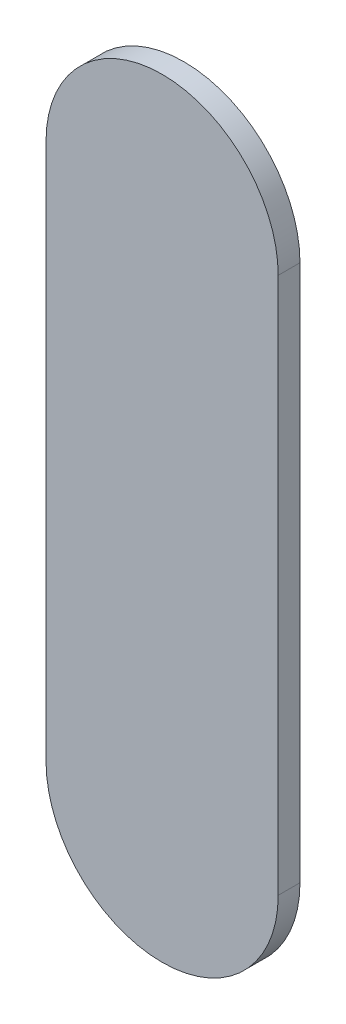
ISO-10303-21;
HEADER;
FILE_DESCRIPTION(('STEP AP214'),'2;1');
FILE_NAME('part.step','',(''),(''),'','','');
FILE_SCHEMA(('AUTOMOTIVE_DESIGN { 1 0 10303 214 1 1 1 1 }'));
ENDSEC;
DATA;
#1=APPLICATION_CONTEXT('core data for automotive mechanical design processes');
#2=APPLICATION_PROTOCOL_DEFINITION('international standard','automotive_design',2000,#1);
#3=PRODUCT_CONTEXT('',#1,'mechanical');
#4=PRODUCT('Part','Part','',(#3));
#5=PRODUCT_RELATED_PRODUCT_CATEGORY('part','',(#4));
#6=PRODUCT_DEFINITION_FORMATION('','',#4);
#7=PRODUCT_DEFINITION_CONTEXT('part definition',#1,'design');
#8=PRODUCT_DEFINITION('design','',#6,#7);
#9=PRODUCT_DEFINITION_SHAPE('','',#8);
#10=(LENGTH_UNIT() NAMED_UNIT(*) SI_UNIT(.MILLI.,.METRE.));
#11=(NAMED_UNIT(*) PLANE_ANGLE_UNIT() SI_UNIT($,.RADIAN.));
#12=(NAMED_UNIT(*) SI_UNIT($,.STERADIAN.) SOLID_ANGLE_UNIT());
#13=UNCERTAINTY_MEASURE_WITH_UNIT(LENGTH_MEASURE(1.E-05),#10,'distance_accuracy_value','');
#14=(GEOMETRIC_REPRESENTATION_CONTEXT(3) GLOBAL_UNCERTAINTY_ASSIGNED_CONTEXT((#13)) GLOBAL_UNIT_ASSIGNED_CONTEXT((#10,
#11,#12)) REPRESENTATION_CONTEXT('',''));
#15=CARTESIAN_POINT('',(0.,0.,0.));
#16=DIRECTION('',(0.,0.,1.));
#17=DIRECTION('',(1.,0.,0.));
#18=AXIS2_PLACEMENT_3D('',#15,#16,#17);
#19=CARTESIAN_POINT('',(0.,18.5,1.5));
#20=DIRECTION('',(0.,0.,-1.));
#21=DIRECTION('',(-1.,0.,0.));
#22=AXIS2_PLACEMENT_3D('',#19,#20,#21);
#23=CYLINDRICAL_SURFACE('',#22,8.);
#24=CARTESIAN_POINT('',(0.,18.5,0.));
#25=DIRECTION('',(0.,0.,1.));
#26=DIRECTION('',(1.,0.,0.));
#27=AXIS2_PLACEMENT_3D('',#24,#25,#26);
#28=CIRCLE('',#27,8.);
#29=CARTESIAN_POINT('',(8.,18.5,0.));
#30=VERTEX_POINT('',#29);
#31=CARTESIAN_POINT('',(-8.,18.5,0.));
#32=VERTEX_POINT('',#31);
#33=EDGE_CURVE('E101',#30,#32,#28,.T.);
#34=ORIENTED_EDGE('',*,*,#33,.T.);
#35=DIRECTION('',(0.,0.,-1.));
#36=VECTOR('',#35,1.);
#37=CARTESIAN_POINT('',(-8.,18.5,1.5));
#38=LINE('',#37,#36);
#39=CARTESIAN_POINT('',(-8.,18.5,1.5));
#40=VERTEX_POINT('',#39);
#41=EDGE_CURVE('E11',#40,#32,#38,.T.);
#42=ORIENTED_EDGE('',*,*,#41,.F.);
#43=CARTESIAN_POINT('',(0.,18.5,1.5));
#44=DIRECTION('',(0.,0.,1.));
#45=DIRECTION('',(1.,0.,0.));
#46=AXIS2_PLACEMENT_3D('',#43,#44,#45);
#47=CIRCLE('',#46,8.);
#48=CARTESIAN_POINT('',(8.,18.5,1.5));
#49=VERTEX_POINT('',#48);
#50=EDGE_CURVE('E89',#49,#40,#47,.T.);
#51=ORIENTED_EDGE('',*,*,#50,.F.);
#52=DIRECTION('',(0.,0.,-1.));
#53=VECTOR('',#52,1.);
#54=CARTESIAN_POINT('',(8.,18.5,1.5));
#55=LINE('',#54,#53);
#56=EDGE_CURVE('E97',#49,#30,#55,.T.);
#57=ORIENTED_EDGE('',*,*,#56,.T.);
#58=EDGE_LOOP('',(#34,#42,#51,#57));
#59=FACE_BOUND('',#58,.T.);
#60=ADVANCED_FACE('F38',(#59),#23,.T.);
#61=CARTESIAN_POINT('',(-8.,18.5,1.5));
#62=DIRECTION('',(1.,0.,0.));
#63=DIRECTION('',(0.,0.,-1.));
#64=AXIS2_PLACEMENT_3D('',#61,#62,#63);
#65=PLANE('',#64);
#66=DIRECTION('',(0.,-1.,0.));
#67=VECTOR('',#66,1.);
#68=CARTESIAN_POINT('',(-8.,18.5,0.));
#69=LINE('',#68,#67);
#70=CARTESIAN_POINT('',(-8.,-18.5,0.));
#71=VERTEX_POINT('',#70);
#72=EDGE_CURVE('E93',#32,#71,#69,.T.);
#73=ORIENTED_EDGE('',*,*,#72,.T.);
#74=DIRECTION('',(0.,0.,-1.));
#75=VECTOR('',#74,1.);
#76=CARTESIAN_POINT('',(-8.,-18.5,1.5));
#77=LINE('',#76,#75);
#78=CARTESIAN_POINT('',(-8.,-18.5,1.5));
#79=VERTEX_POINT('',#78);
#80=EDGE_CURVE('E46',#79,#71,#77,.T.);
#81=ORIENTED_EDGE('',*,*,#80,.F.);
#82=DIRECTION('',(0.,-1.,0.));
#83=VECTOR('',#82,1.);
#84=CARTESIAN_POINT('',(-8.,18.5,1.5));
#85=LINE('',#84,#83);
#86=EDGE_CURVE('E84',#40,#79,#85,.T.);
#87=ORIENTED_EDGE('',*,*,#86,.F.);
#88=ORIENTED_EDGE('',*,*,#41,.T.);
#89=EDGE_LOOP('',(#73,#81,#87,#88));
#90=FACE_BOUND('',#89,.T.);
#91=ADVANCED_FACE('F92',(#90),#65,.F.);
#92=CARTESIAN_POINT('',(0.,-18.5,1.5));
#93=DIRECTION('',(0.,0.,-1.));
#94=DIRECTION('',(-1.,0.,0.));
#95=AXIS2_PLACEMENT_3D('',#92,#93,#94);
#96=CYLINDRICAL_SURFACE('',#95,8.);
#97=CARTESIAN_POINT('',(0.,-18.5,0.));
#98=DIRECTION('',(0.,0.,1.));
#99=DIRECTION('',(1.,0.,0.));
#100=AXIS2_PLACEMENT_3D('',#97,#98,#99);
#101=CIRCLE('',#100,8.);
#102=CARTESIAN_POINT('',(8.,-18.5,0.));
#103=VERTEX_POINT('',#102);
#104=EDGE_CURVE('E71',#71,#103,#101,.T.);
#105=ORIENTED_EDGE('',*,*,#104,.T.);
#106=DIRECTION('',(0.,0.,-1.));
#107=VECTOR('',#106,1.);
#108=CARTESIAN_POINT('',(8.,-18.5,1.5));
#109=LINE('',#108,#107);
#110=CARTESIAN_POINT('',(8.,-18.5,1.5));
#111=VERTEX_POINT('',#110);
#112=EDGE_CURVE('E94',#111,#103,#109,.T.);
#113=ORIENTED_EDGE('',*,*,#112,.F.);
#114=CARTESIAN_POINT('',(0.,-18.5,1.5));
#115=DIRECTION('',(0.,0.,1.));
#116=DIRECTION('',(1.,0.,0.));
#117=AXIS2_PLACEMENT_3D('',#114,#115,#116);
#118=CIRCLE('',#117,8.);
#119=EDGE_CURVE('E87',#79,#111,#118,.T.);
#120=ORIENTED_EDGE('',*,*,#119,.F.);
#121=ORIENTED_EDGE('',*,*,#80,.T.);
#122=EDGE_LOOP('',(#105,#113,#120,#121));
#123=FACE_BOUND('',#122,.T.);
#124=ADVANCED_FACE('F95',(#123),#96,.T.);
#125=CARTESIAN_POINT('',(8.,18.5,1.5));
#126=DIRECTION('',(-1.,0.,0.));
#127=DIRECTION('',(0.,0.,1.));
#128=AXIS2_PLACEMENT_3D('',#125,#126,#127);
#129=PLANE('',#128);
#130=DIRECTION('',(0.,1.,0.));
#131=VECTOR('',#130,1.);
#132=CARTESIAN_POINT('',(8.,18.5,0.));
#133=LINE('',#132,#131);
#134=EDGE_CURVE('E77',#103,#30,#133,.T.);
#135=ORIENTED_EDGE('',*,*,#134,.T.);
#136=ORIENTED_EDGE('',*,*,#56,.F.);
#137=DIRECTION('',(0.,1.,0.));
#138=VECTOR('',#137,1.);
#139=CARTESIAN_POINT('',(8.,18.5,1.5));
#140=LINE('',#139,#138);
#141=EDGE_CURVE('E54',#111,#49,#140,.T.);
#142=ORIENTED_EDGE('',*,*,#141,.F.);
#143=ORIENTED_EDGE('',*,*,#112,.T.);
#144=EDGE_LOOP('',(#135,#136,#142,#143));
#145=FACE_BOUND('',#144,.T.);
#146=ADVANCED_FACE('F108',(#145),#129,.F.);
#147=CARTESIAN_POINT('',(0.,18.5,1.5));
#148=DIRECTION('',(0.,0.,1.));
#149=DIRECTION('',(1.,0.,0.));
#150=AXIS2_PLACEMENT_3D('',#147,#148,#149);
#151=PLANE('',#150);
#152=ORIENTED_EDGE('',*,*,#50,.T.);
#153=ORIENTED_EDGE('',*,*,#86,.T.);
#154=ORIENTED_EDGE('',*,*,#119,.T.);
#155=ORIENTED_EDGE('',*,*,#141,.T.);
#156=EDGE_LOOP('',(#152,#153,#154,#155));
#157=FACE_BOUND('',#156,.T.);
#158=ADVANCED_FACE('F85',(#157),#151,.T.);
#159=CARTESIAN_POINT('',(0.,18.5,0.));
#160=DIRECTION('',(0.,0.,1.));
#161=DIRECTION('',(1.,0.,0.));
#162=AXIS2_PLACEMENT_3D('',#159,#160,#161);
#163=PLANE('',#162);
#164=ORIENTED_EDGE('',*,*,#33,.F.);
#165=ORIENTED_EDGE('',*,*,#134,.F.);
#166=ORIENTED_EDGE('',*,*,#104,.F.);
#167=ORIENTED_EDGE('',*,*,#72,.F.);
#168=EDGE_LOOP('',(#164,#165,#166,#167));
#169=FACE_BOUND('',#168,.T.);
#170=ADVANCED_FACE('F111',(#169),#163,.F.);
#171=CLOSED_SHELL('',(#60,#91,#124,#146,#158,#170));
#172=MANIFOLD_SOLID_BREP('B2',#171);
#173=ADVANCED_BREP_SHAPE_REPRESENTATION('',(#18,#172),#14);
#174=SHAPE_DEFINITION_REPRESENTATION(#9,#173);
ENDSEC;
END-ISO-10303-21;
